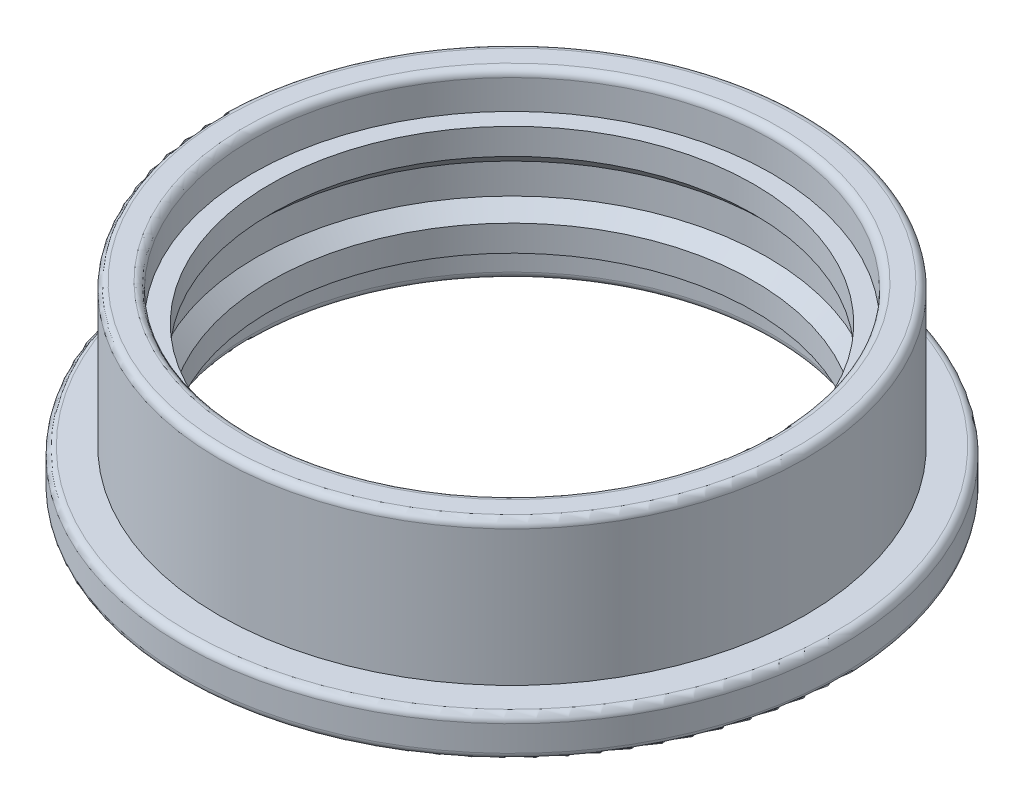
ISO-10303-21;
HEADER;
FILE_DESCRIPTION(('STEP AP214'),'2;1');
FILE_NAME('part.step','',(''),(''),'','','');
FILE_SCHEMA(('AUTOMOTIVE_DESIGN { 1 0 10303 214 1 1 1 1 }'));
ENDSEC;
DATA;
#1=APPLICATION_CONTEXT('core data for automotive mechanical design processes');
#2=APPLICATION_PROTOCOL_DEFINITION('international standard','automotive_design',2000,#1);
#3=PRODUCT_CONTEXT('',#1,'mechanical');
#4=PRODUCT('Part','Part','',(#3));
#5=PRODUCT_RELATED_PRODUCT_CATEGORY('part','',(#4));
#6=PRODUCT_DEFINITION_FORMATION('','',#4);
#7=PRODUCT_DEFINITION_CONTEXT('part definition',#1,'design');
#8=PRODUCT_DEFINITION('design','',#6,#7);
#9=PRODUCT_DEFINITION_SHAPE('','',#8);
#10=(LENGTH_UNIT() NAMED_UNIT(*) SI_UNIT(.MILLI.,.METRE.));
#11=(NAMED_UNIT(*) PLANE_ANGLE_UNIT() SI_UNIT($,.RADIAN.));
#12=(NAMED_UNIT(*) SI_UNIT($,.STERADIAN.) SOLID_ANGLE_UNIT());
#13=UNCERTAINTY_MEASURE_WITH_UNIT(LENGTH_MEASURE(1.E-05),#10,'distance_accuracy_value','');
#14=(GEOMETRIC_REPRESENTATION_CONTEXT(3) GLOBAL_UNCERTAINTY_ASSIGNED_CONTEXT((#13)) GLOBAL_UNIT_ASSIGNED_CONTEXT((#10,
#11,#12)) REPRESENTATION_CONTEXT('',''));
#15=CARTESIAN_POINT('',(0.,0.,0.));
#16=DIRECTION('',(0.,0.,1.));
#17=DIRECTION('',(1.,0.,0.));
#18=AXIS2_PLACEMENT_3D('',#15,#16,#17);
#19=CARTESIAN_POINT('',(0.,5.,0.));
#20=DIRECTION('',(0.,-1.,0.));
#21=DIRECTION('',(0.,0.,-1.));
#22=AXIS2_PLACEMENT_3D('',#19,#20,#21);
#23=CYLINDRICAL_SURFACE('',#22,6.6);
#24=CARTESIAN_POINT('',(0.,4.,0.));
#25=DIRECTION('',(0.,1.,0.));
#26=DIRECTION('',(0.,0.,1.));
#27=AXIS2_PLACEMENT_3D('',#24,#25,#26);
#28=CIRCLE('',#27,6.6);
#29=CARTESIAN_POINT('',(0.,4.,6.6));
#30=VERTEX_POINT('',#29);
#31=EDGE_CURVE('E87',#30,#30,#28,.T.);
#32=ORIENTED_EDGE('',*,*,#31,.T.);
#33=EDGE_LOOP('',(#32));
#34=FACE_BOUND('',#33,.T.);
#35=CARTESIAN_POINT('',(0.,3.28921356237309,0.));
#36=DIRECTION('',(0.,-1.,0.));
#37=DIRECTION('',(0.,0.,-1.));
#38=AXIS2_PLACEMENT_3D('',#35,#36,#37);
#39=CIRCLE('',#38,6.6);
#40=CARTESIAN_POINT('',(0.,3.28921356237309,-6.6));
#41=VERTEX_POINT('',#40);
#42=EDGE_CURVE('E75',#41,#41,#39,.T.);
#43=ORIENTED_EDGE('',*,*,#42,.T.);
#44=EDGE_LOOP('',(#43));
#45=FACE_BOUND('',#44,.T.);
#46=ADVANCED_FACE('F36',(#34,#45),#23,.F.);
#47=CARTESIAN_POINT('',(0.,1.,0.));
#48=DIRECTION('',(0.,1.,0.));
#49=DIRECTION('',(0.,0.,1.));
#50=AXIS2_PLACEMENT_3D('',#47,#48,#49);
#51=CIRCLE('',#50,6.6);
#52=CARTESIAN_POINT('',(0.,1.,6.6));
#53=VERTEX_POINT('',#52);
#54=EDGE_CURVE('E83',#53,#53,#51,.T.);
#55=ORIENTED_EDGE('',*,*,#54,.F.);
#56=EDGE_LOOP('',(#55));
#57=FACE_BOUND('',#56,.T.);
#58=CARTESIAN_POINT('',(0.,1.71078643762691,0.));
#59=DIRECTION('',(0.,1.,0.));
#60=DIRECTION('',(0.,0.,1.));
#61=AXIS2_PLACEMENT_3D('',#58,#59,#60);
#62=CIRCLE('',#61,6.6);
#63=CARTESIAN_POINT('',(0.,1.71078643762691,6.6));
#64=VERTEX_POINT('',#63);
#65=EDGE_CURVE('E79',#64,#64,#62,.T.);
#66=ORIENTED_EDGE('',*,*,#65,.T.);
#67=EDGE_LOOP('',(#66));
#68=FACE_BOUND('',#67,.T.);
#69=ADVANCED_FACE('F120',(#57,#68),#23,.F.);
#70=CARTESIAN_POINT('',(0.,5.,0.));
#71=DIRECTION('',(0.,1.,0.));
#72=DIRECTION('',(0.,0.,1.));
#73=AXIS2_PLACEMENT_3D('',#70,#71,#72);
#74=PLANE('',#73);
#75=CARTESIAN_POINT('',(0.,5.,0.));
#76=DIRECTION('',(0.,1.,0.));
#77=DIRECTION('',(0.,0.,1.));
#78=AXIS2_PLACEMENT_3D('',#75,#76,#77);
#79=CIRCLE('',#78,7.8);
#80=CARTESIAN_POINT('',(0.,5.,7.8));
#81=VERTEX_POINT('',#80);
#82=EDGE_CURVE('E47',#81,#81,#79,.T.);
#83=ORIENTED_EDGE('',*,*,#82,.T.);
#84=EDGE_LOOP('',(#83));
#85=FACE_BOUND('',#84,.T.);
#86=CARTESIAN_POINT('',(0.,5.,0.));
#87=DIRECTION('',(0.,1.,0.));
#88=DIRECTION('',(0.,0.,1.));
#89=AXIS2_PLACEMENT_3D('',#86,#87,#88);
#90=CIRCLE('',#89,7.3);
#91=CARTESIAN_POINT('',(0.,5.,7.3));
#92=VERTEX_POINT('',#91);
#93=EDGE_CURVE('E51',#92,#92,#90,.F.);
#94=ORIENTED_EDGE('',*,*,#93,.T.);
#95=EDGE_LOOP('',(#94));
#96=FACE_BOUND('',#95,.T.);
#97=ADVANCED_FACE('F126',(#85,#96),#74,.T.);
#98=CARTESIAN_POINT('',(0.,5.,0.));
#99=DIRECTION('',(0.,-1.,0.));
#100=DIRECTION('',(0.,0.,-1.));
#101=AXIS2_PLACEMENT_3D('',#98,#99,#100);
#102=CYLINDRICAL_SURFACE('',#101,9.);
#103=CARTESIAN_POINT('',(0.,0.2,0.));
#104=DIRECTION('',(0.,1.,0.));
#105=DIRECTION('',(0.,0.,1.));
#106=AXIS2_PLACEMENT_3D('',#103,#104,#105);
#107=CIRCLE('',#106,9.);
#108=CARTESIAN_POINT('',(0.,0.2,9.));
#109=VERTEX_POINT('',#108);
#110=EDGE_CURVE('E59',#109,#109,#107,.T.);
#111=ORIENTED_EDGE('',*,*,#110,.T.);
#112=EDGE_LOOP('',(#111));
#113=FACE_BOUND('',#112,.T.);
#114=CARTESIAN_POINT('',(0.,0.900000000000001,0.));
#115=DIRECTION('',(0.,1.,0.));
#116=DIRECTION('',(0.,0.,1.));
#117=AXIS2_PLACEMENT_3D('',#114,#115,#116);
#118=CIRCLE('',#117,9.);
#119=CARTESIAN_POINT('',(0.,0.900000000000001,9.));
#120=VERTEX_POINT('',#119);
#121=EDGE_CURVE('E62',#120,#120,#118,.F.);
#122=ORIENTED_EDGE('',*,*,#121,.T.);
#123=EDGE_LOOP('',(#122));
#124=FACE_BOUND('',#123,.T.);
#125=ADVANCED_FACE('F135',(#113,#124),#102,.T.);
#126=CARTESIAN_POINT('',(0.,0.,0.));
#127=DIRECTION('',(0.,1.,0.));
#128=DIRECTION('',(0.,0.,1.));
#129=AXIS2_PLACEMENT_3D('',#126,#127,#128);
#130=PLANE('',#129);
#131=CARTESIAN_POINT('',(0.,0.,0.));
#132=DIRECTION('',(0.,1.,0.));
#133=DIRECTION('',(0.,0.,1.));
#134=AXIS2_PLACEMENT_3D('',#131,#132,#133);
#135=CIRCLE('',#134,7.3);
#136=CARTESIAN_POINT('',(0.,0.,7.3));
#137=VERTEX_POINT('',#136);
#138=EDGE_CURVE('E68',#137,#137,#135,.T.);
#139=ORIENTED_EDGE('',*,*,#138,.T.);
#140=EDGE_LOOP('',(#139));
#141=FACE_BOUND('',#140,.T.);
#142=CARTESIAN_POINT('',(0.,0.,0.));
#143=DIRECTION('',(0.,1.,0.));
#144=DIRECTION('',(0.,0.,1.));
#145=AXIS2_PLACEMENT_3D('',#142,#143,#144);
#146=CIRCLE('',#145,8.8);
#147=CARTESIAN_POINT('',(0.,0.,8.8));
#148=VERTEX_POINT('',#147);
#149=EDGE_CURVE('E71',#148,#148,#146,.F.);
#150=ORIENTED_EDGE('',*,*,#149,.T.);
#151=EDGE_LOOP('',(#150));
#152=FACE_BOUND('',#151,.T.);
#153=ADVANCED_FACE('F137',(#141,#152),#130,.F.);
#154=CARTESIAN_POINT('',(0.,1.1,0.));
#155=DIRECTION('',(0.,1.,0.));
#156=DIRECTION('',(0.,0.,1.));
#157=AXIS2_PLACEMENT_3D('',#154,#155,#156);
#158=PLANE('',#157);
#159=CARTESIAN_POINT('',(0.,1.1,0.));
#160=DIRECTION('',(0.,1.,0.));
#161=DIRECTION('',(0.,0.,1.));
#162=AXIS2_PLACEMENT_3D('',#159,#160,#161);
#163=CIRCLE('',#162,8.8);
#164=CARTESIAN_POINT('',(0.,1.1,8.8));
#165=VERTEX_POINT('',#164);
#166=EDGE_CURVE('E56',#165,#165,#163,.T.);
#167=ORIENTED_EDGE('',*,*,#166,.T.);
#168=EDGE_LOOP('',(#167));
#169=FACE_BOUND('',#168,.T.);
#170=CARTESIAN_POINT('',(0.,1.1,0.));
#171=DIRECTION('',(0.,1.,0.));
#172=DIRECTION('',(0.,0.,1.));
#173=AXIS2_PLACEMENT_3D('',#170,#171,#172);
#174=CIRCLE('',#173,8.);
#175=CARTESIAN_POINT('',(0.,1.1,8.));
#176=VERTEX_POINT('',#175);
#177=EDGE_CURVE('E74',#176,#176,#174,.T.);
#178=ORIENTED_EDGE('',*,*,#177,.F.);
#179=EDGE_LOOP('',(#178));
#180=FACE_BOUND('',#179,.T.);
#181=ADVANCED_FACE('F131',(#169,#180),#158,.T.);
#182=CARTESIAN_POINT('',(0.,1.1,0.));
#183=DIRECTION('',(0.,1.,0.));
#184=DIRECTION('',(0.,0.,1.));
#185=AXIS2_PLACEMENT_3D('',#182,#183,#184);
#186=CYLINDRICAL_SURFACE('',#185,8.);
#187=CARTESIAN_POINT('',(0.,4.8,0.));
#188=DIRECTION('',(0.,1.,0.));
#189=DIRECTION('',(0.,0.,1.));
#190=AXIS2_PLACEMENT_3D('',#187,#188,#189);
#191=CIRCLE('',#190,8.);
#192=CARTESIAN_POINT('',(0.,4.8,8.));
#193=VERTEX_POINT('',#192);
#194=EDGE_CURVE('E43',#193,#193,#191,.F.);
#195=ORIENTED_EDGE('',*,*,#194,.T.);
#196=EDGE_LOOP('',(#195));
#197=FACE_BOUND('',#196,.T.);
#198=ORIENTED_EDGE('',*,*,#177,.T.);
#199=EDGE_LOOP('',(#198));
#200=FACE_BOUND('',#199,.T.);
#201=ADVANCED_FACE('F213',(#197,#200),#186,.T.);
#202=CARTESIAN_POINT('',(0.,4.,0.));
#203=DIRECTION('',(0.,1.,0.));
#204=DIRECTION('',(0.,0.,1.));
#205=AXIS2_PLACEMENT_3D('',#202,#203,#204);
#206=CYLINDRICAL_SURFACE('',#205,7.1);
#207=CARTESIAN_POINT('',(0.,4.8,0.));
#208=DIRECTION('',(0.,1.,0.));
#209=DIRECTION('',(0.,0.,1.));
#210=AXIS2_PLACEMENT_3D('',#207,#208,#209);
#211=CIRCLE('',#210,7.1);
#212=CARTESIAN_POINT('',(0.,4.8,7.1));
#213=VERTEX_POINT('',#212);
#214=EDGE_CURVE('E10',#213,#213,#211,.T.);
#215=ORIENTED_EDGE('',*,*,#214,.T.);
#216=EDGE_LOOP('',(#215));
#217=FACE_BOUND('',#216,.T.);
#218=CARTESIAN_POINT('',(0.,4.,0.));
#219=DIRECTION('',(0.,1.,0.));
#220=DIRECTION('',(0.,0.,1.));
#221=AXIS2_PLACEMENT_3D('',#218,#219,#220);
#222=CIRCLE('',#221,7.1);
#223=CARTESIAN_POINT('',(0.,4.,7.1));
#224=VERTEX_POINT('',#223);
#225=EDGE_CURVE('E86',#224,#224,#222,.T.);
#226=ORIENTED_EDGE('',*,*,#225,.F.);
#227=EDGE_LOOP('',(#226));
#228=FACE_BOUND('',#227,.T.);
#229=ADVANCED_FACE('F208',(#217,#228),#206,.F.);
#230=CARTESIAN_POINT('',(0.,4.,0.));
#231=DIRECTION('',(0.,1.,0.));
#232=DIRECTION('',(0.,0.,1.));
#233=AXIS2_PLACEMENT_3D('',#230,#231,#232);
#234=PLANE('',#233);
#235=ORIENTED_EDGE('',*,*,#31,.F.);
#236=EDGE_LOOP('',(#235));
#237=FACE_BOUND('',#236,.T.);
#238=ORIENTED_EDGE('',*,*,#225,.T.);
#239=EDGE_LOOP('',(#238));
#240=FACE_BOUND('',#239,.T.);
#241=ADVANCED_FACE('F198',(#237,#240),#234,.T.);
#242=CARTESIAN_POINT('',(0.,0.,0.));
#243=DIRECTION('',(0.,1.,0.));
#244=DIRECTION('',(0.,0.,1.));
#245=AXIS2_PLACEMENT_3D('',#242,#243,#244);
#246=CYLINDRICAL_SURFACE('',#245,7.1);
#247=CARTESIAN_POINT('',(0.,0.2,0.));
#248=DIRECTION('',(0.,1.,0.));
#249=DIRECTION('',(0.,0.,1.));
#250=AXIS2_PLACEMENT_3D('',#247,#248,#249);
#251=CIRCLE('',#250,7.1);
#252=CARTESIAN_POINT('',(0.,0.2,7.1));
#253=VERTEX_POINT('',#252);
#254=EDGE_CURVE('E65',#253,#253,#251,.F.);
#255=ORIENTED_EDGE('',*,*,#254,.T.);
#256=EDGE_LOOP('',(#255));
#257=FACE_BOUND('',#256,.T.);
#258=CARTESIAN_POINT('',(0.,1.,0.));
#259=DIRECTION('',(0.,1.,0.));
#260=DIRECTION('',(0.,0.,1.));
#261=AXIS2_PLACEMENT_3D('',#258,#259,#260);
#262=CIRCLE('',#261,7.1);
#263=CARTESIAN_POINT('',(0.,1.,7.1));
#264=VERTEX_POINT('',#263);
#265=EDGE_CURVE('E78',#264,#264,#262,.T.);
#266=ORIENTED_EDGE('',*,*,#265,.T.);
#267=EDGE_LOOP('',(#266));
#268=FACE_BOUND('',#267,.T.);
#269=ADVANCED_FACE('F192',(#257,#268),#246,.F.);
#270=CARTESIAN_POINT('',(0.,1.,0.));
#271=DIRECTION('',(0.,1.,0.));
#272=DIRECTION('',(0.,0.,1.));
#273=AXIS2_PLACEMENT_3D('',#270,#271,#272);
#274=PLANE('',#273);
#275=ORIENTED_EDGE('',*,*,#54,.T.);
#276=EDGE_LOOP('',(#275));
#277=FACE_BOUND('',#276,.T.);
#278=ORIENTED_EDGE('',*,*,#265,.F.);
#279=EDGE_LOOP('',(#278));
#280=FACE_BOUND('',#279,.T.);
#281=ADVANCED_FACE('F197',(#277,#280),#274,.F.);
#282=CARTESIAN_POINT('',(0.,4.,0.));
#283=DIRECTION('',(0.,-1.,0.));
#284=DIRECTION('',(0.,0.,-1.));
#285=AXIS2_PLACEMENT_3D('',#282,#283,#284);
#286=CONICAL_SURFACE('',#285,5.8892135623731,0.785398163397448);
#287=ORIENTED_EDGE('',*,*,#42,.F.);
#288=EDGE_LOOP('',(#287));
#289=FACE_BOUND('',#288,.T.);
#290=CARTESIAN_POINT('',(0.,2.91421356237309,0.));
#291=DIRECTION('',(0.,-1.,0.));
#292=DIRECTION('',(0.,0.,-1.));
#293=AXIS2_PLACEMENT_3D('',#290,#291,#292);
#294=CIRCLE('',#293,6.975);
#295=CARTESIAN_POINT('',(0.,2.91421356237309,-6.975));
#296=VERTEX_POINT('',#295);
#297=EDGE_CURVE('E98',#296,#296,#294,.T.);
#298=ORIENTED_EDGE('',*,*,#297,.T.);
#299=EDGE_LOOP('',(#298));
#300=FACE_BOUND('',#299,.T.);
#301=ADVANCED_FACE('F102',(#289,#300),#286,.F.);
#302=CARTESIAN_POINT('',(0.,2.08578643762691,0.));
#303=DIRECTION('',(0.,1.,0.));
#304=DIRECTION('',(0.,0.,1.));
#305=AXIS2_PLACEMENT_3D('',#302,#303,#304);
#306=CONICAL_SURFACE('',#305,6.975,0.785398163397448);
#307=ORIENTED_EDGE('',*,*,#65,.F.);
#308=EDGE_LOOP('',(#307));
#309=FACE_BOUND('',#308,.T.);
#310=CARTESIAN_POINT('',(0.,2.08578643762691,0.));
#311=DIRECTION('',(0.,-1.,0.));
#312=DIRECTION('',(0.,0.,-1.));
#313=AXIS2_PLACEMENT_3D('',#310,#311,#312);
#314=CIRCLE('',#313,6.975);
#315=CARTESIAN_POINT('',(0.,2.08578643762691,-6.975));
#316=VERTEX_POINT('',#315);
#317=EDGE_CURVE('E82',#316,#316,#314,.T.);
#318=ORIENTED_EDGE('',*,*,#317,.F.);
#319=EDGE_LOOP('',(#318));
#320=FACE_BOUND('',#319,.T.);
#321=ADVANCED_FACE('F107',(#309,#320),#306,.F.);
#322=CARTESIAN_POINT('',(0.,0.,0.));
#323=DIRECTION('',(0.,-1.,0.));
#324=DIRECTION('',(0.,0.,-1.));
#325=AXIS2_PLACEMENT_3D('',#322,#323,#324);
#326=CYLINDRICAL_SURFACE('',#325,6.975);
#327=ORIENTED_EDGE('',*,*,#317,.T.);
#328=EDGE_LOOP('',(#327));
#329=FACE_BOUND('',#328,.T.);
#330=ORIENTED_EDGE('',*,*,#297,.F.);
#331=EDGE_LOOP('',(#330));
#332=FACE_BOUND('',#331,.T.);
#333=ADVANCED_FACE('F104',(#329,#332),#326,.F.);
#334=CARTESIAN_POINT('',(0.,0.2,0.));
#335=DIRECTION('',(0.,1.,0.));
#336=DIRECTION('',(0.,0.,1.));
#337=AXIS2_PLACEMENT_3D('',#334,#335,#336);
#338=TOROIDAL_SURFACE('',#337,7.3,0.2);
#339=ORIENTED_EDGE('',*,*,#254,.F.);
#340=EDGE_LOOP('',(#339));
#341=FACE_BOUND('',#340,.T.);
#342=ORIENTED_EDGE('',*,*,#138,.F.);
#343=EDGE_LOOP('',(#342));
#344=FACE_BOUND('',#343,.T.);
#345=ADVANCED_FACE('F106',(#341,#344),#338,.T.);
#346=CARTESIAN_POINT('',(0.,0.2,0.));
#347=DIRECTION('',(0.,1.,0.));
#348=DIRECTION('',(0.,0.,1.));
#349=AXIS2_PLACEMENT_3D('',#346,#347,#348);
#350=TOROIDAL_SURFACE('',#349,8.8,0.2);
#351=ORIENTED_EDGE('',*,*,#149,.F.);
#352=EDGE_LOOP('',(#351));
#353=FACE_BOUND('',#352,.T.);
#354=ORIENTED_EDGE('',*,*,#110,.F.);
#355=EDGE_LOOP('',(#354));
#356=FACE_BOUND('',#355,.T.);
#357=ADVANCED_FACE('F114',(#353,#356),#350,.T.);
#358=CARTESIAN_POINT('',(0.,0.900000000000001,0.));
#359=DIRECTION('',(0.,1.,0.));
#360=DIRECTION('',(0.,0.,1.));
#361=AXIS2_PLACEMENT_3D('',#358,#359,#360);
#362=TOROIDAL_SURFACE('',#361,8.8,0.2);
#363=ORIENTED_EDGE('',*,*,#121,.F.);
#364=EDGE_LOOP('',(#363));
#365=FACE_BOUND('',#364,.T.);
#366=ORIENTED_EDGE('',*,*,#166,.F.);
#367=EDGE_LOOP('',(#366));
#368=FACE_BOUND('',#367,.T.);
#369=ADVANCED_FACE('F146',(#365,#368),#362,.T.);
#370=CARTESIAN_POINT('',(0.,4.8,0.));
#371=DIRECTION('',(0.,1.,0.));
#372=DIRECTION('',(0.,0.,1.));
#373=AXIS2_PLACEMENT_3D('',#370,#371,#372);
#374=TOROIDAL_SURFACE('',#373,7.8,0.2);
#375=ORIENTED_EDGE('',*,*,#194,.F.);
#376=EDGE_LOOP('',(#375));
#377=FACE_BOUND('',#376,.T.);
#378=ORIENTED_EDGE('',*,*,#82,.F.);
#379=EDGE_LOOP('',(#378));
#380=FACE_BOUND('',#379,.T.);
#381=ADVANCED_FACE('F149',(#377,#380),#374,.T.);
#382=CARTESIAN_POINT('',(0.,4.8,0.));
#383=DIRECTION('',(0.,1.,0.));
#384=DIRECTION('',(0.,0.,1.));
#385=AXIS2_PLACEMENT_3D('',#382,#383,#384);
#386=TOROIDAL_SURFACE('',#385,7.3,0.2);
#387=ORIENTED_EDGE('',*,*,#93,.F.);
#388=EDGE_LOOP('',(#387));
#389=FACE_BOUND('',#388,.T.);
#390=ORIENTED_EDGE('',*,*,#214,.F.);
#391=EDGE_LOOP('',(#390));
#392=FACE_BOUND('',#391,.T.);
#393=ADVANCED_FACE('F38',(#389,#392),#386,.T.);
#394=CLOSED_SHELL('',(#46,#69,#97,#125,#153,#181,#201,#229,#241,#269,#281,#301,#321,#333,#345,
#357,#369,#381,#393));
#395=MANIFOLD_SOLID_BREP('B2',#394);
#396=ADVANCED_BREP_SHAPE_REPRESENTATION('',(#18,#395),#14);
#397=SHAPE_DEFINITION_REPRESENTATION(#9,#396);
ENDSEC;
END-ISO-10303-21;
